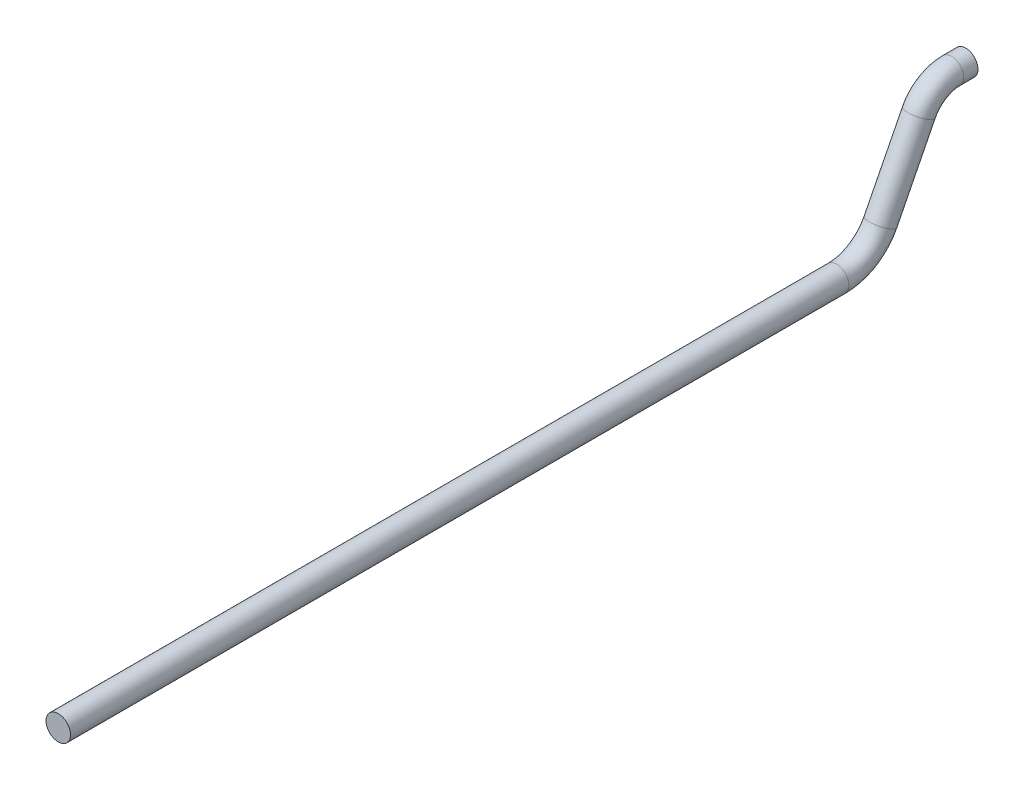
ISO-10303-21;
HEADER;
FILE_DESCRIPTION(('STEP AP214'),'2;1');
FILE_NAME('part.step','',(''),(''),'','','');
FILE_SCHEMA(('AUTOMOTIVE_DESIGN { 1 0 10303 214 1 1 1 1 }'));
ENDSEC;
DATA;
#1=APPLICATION_CONTEXT('core data for automotive mechanical design processes');
#2=APPLICATION_PROTOCOL_DEFINITION('international standard','automotive_design',2000,#1);
#3=PRODUCT_CONTEXT('',#1,'mechanical');
#4=PRODUCT('Part','Part','',(#3));
#5=PRODUCT_RELATED_PRODUCT_CATEGORY('part','',(#4));
#6=PRODUCT_DEFINITION_FORMATION('','',#4);
#7=PRODUCT_DEFINITION_CONTEXT('part definition',#1,'design');
#8=PRODUCT_DEFINITION('design','',#6,#7);
#9=PRODUCT_DEFINITION_SHAPE('','',#8);
#10=(LENGTH_UNIT() NAMED_UNIT(*) SI_UNIT(.MILLI.,.METRE.));
#11=(NAMED_UNIT(*) PLANE_ANGLE_UNIT() SI_UNIT($,.RADIAN.));
#12=(NAMED_UNIT(*) SI_UNIT($,.STERADIAN.) SOLID_ANGLE_UNIT());
#13=UNCERTAINTY_MEASURE_WITH_UNIT(LENGTH_MEASURE(1.E-05),#10,'distance_accuracy_value','');
#14=(GEOMETRIC_REPRESENTATION_CONTEXT(3) GLOBAL_UNCERTAINTY_ASSIGNED_CONTEXT((#13)) GLOBAL_UNIT_ASSIGNED_CONTEXT((#10,
#11,#12)) REPRESENTATION_CONTEXT('',''));
#15=CARTESIAN_POINT('',(0.,0.,0.));
#16=DIRECTION('',(0.,0.,1.));
#17=DIRECTION('',(1.,0.,0.));
#18=AXIS2_PLACEMENT_3D('',#15,#16,#17);
#19=CARTESIAN_POINT('',(0.,-50.,370.));
#20=DIRECTION('',(0.,0.,-1.));
#21=DIRECTION('',(-1.,0.,0.));
#22=AXIS2_PLACEMENT_3D('',#19,#20,#21);
#23=PLANE('',#22);
#24=CARTESIAN_POINT('',(0.,-50.,370.));
#25=DIRECTION('',(0.,0.,-1.));
#26=DIRECTION('',(-1.,0.,0.));
#27=AXIS2_PLACEMENT_3D('',#24,#25,#26);
#28=CIRCLE('',#27,5.);
#29=CARTESIAN_POINT('',(-5.,-50.,370.));
#30=VERTEX_POINT('',#29);
#31=EDGE_CURVE('E82',#30,#30,#28,.T.);
#32=ORIENTED_EDGE('',*,*,#31,.F.);
#33=EDGE_LOOP('',(#32));
#34=FACE_BOUND('',#33,.T.);
#35=ADVANCED_FACE('F55',(#34),#23,.F.);
#36=CARTESIAN_POINT('',(0.,0.,0.));
#37=DIRECTION('',(0.,0.,-1.));
#38=DIRECTION('',(-1.,0.,0.));
#39=AXIS2_PLACEMENT_3D('',#36,#37,#38);
#40=PLANE('',#39);
#41=CARTESIAN_POINT('',(0.,0.,0.));
#42=DIRECTION('',(0.,0.,-1.));
#43=DIRECTION('',(-1.,0.,0.));
#44=AXIS2_PLACEMENT_3D('',#41,#42,#43);
#45=CIRCLE('',#44,5.);
#46=CARTESIAN_POINT('',(-5.,0.,0.));
#47=VERTEX_POINT('',#46);
#48=EDGE_CURVE('E11',#47,#47,#45,.T.);
#49=ORIENTED_EDGE('',*,*,#48,.T.);
#50=EDGE_LOOP('',(#49));
#51=FACE_BOUND('',#50,.T.);
#52=ADVANCED_FACE('F90',(#51),#40,.T.);
#53=CARTESIAN_POINT('',(0.,-50.,370.));
#54=DIRECTION('',(0.,0.,-1.));
#55=DIRECTION('',(-1.,0.,0.));
#56=AXIS2_PLACEMENT_3D('',#53,#54,#55);
#57=CYLINDRICAL_SURFACE('',#56,5.);
#58=CARTESIAN_POINT('',(0.,-50.,52.6209699499409));
#59=DIRECTION('',(0.,0.,-1.));
#60=DIRECTION('',(-1.,0.,0.));
#61=AXIS2_PLACEMENT_3D('',#58,#59,#60);
#62=CIRCLE('',#61,5.);
#63=CARTESIAN_POINT('',(0.,-55.0000000000021,52.6209699499409));
#64=VERTEX_POINT('',#63);
#65=EDGE_CURVE('E78',#64,#64,#62,.T.);
#66=ORIENTED_EDGE('',*,*,#65,.F.);
#67=EDGE_LOOP('',(#66));
#68=FACE_BOUND('',#67,.T.);
#69=ORIENTED_EDGE('',*,*,#31,.T.);
#70=EDGE_LOOP('',(#69));
#71=FACE_BOUND('',#70,.T.);
#72=ADVANCED_FACE('F87',(#68,#71),#57,.T.);
#73=CARTESIAN_POINT('',(0.,-30.,52.6209699499408));
#74=DIRECTION('',(1.,0.,0.));
#75=DIRECTION('',(0.,0.,-1.));
#76=AXIS2_PLACEMENT_3D('',#73,#74,#75);
#77=TOROIDAL_SURFACE('',#76,20.0000000000021,5.);
#78=CARTESIAN_POINT('',(0.,-39.039421146903,34.7803179066739));
#79=DIRECTION('',(0.,0.892032602163345,-0.451971057345149));
#80=DIRECTION('',(-1.,0.,0.));
#81=AXIS2_PLACEMENT_3D('',#78,#79,#80);
#82=CIRCLE('',#81,5.);
#83=CARTESIAN_POINT('',(0.,-41.2992764336297,30.3201548958554));
#84=VERTEX_POINT('',#83);
#85=EDGE_CURVE('E72',#84,#84,#82,.T.);
#86=CARTESIAN_POINT('',(0.,-30.,52.6209699499408));
#87=DIRECTION('',(1.,0.,0.));
#88=DIRECTION('',(0.,0.,-1.));
#89=AXIS2_PLACEMENT_3D('',#86,#87,#88);
#90=CIRCLE('',#89,25.0000000000021);
#91=EDGE_CURVE('',#64,#84,#90,.T.);
#92=ORIENTED_EDGE('',*,*,#65,.T.);
#93=ORIENTED_EDGE('',*,*,#85,.F.);
#94=ORIENTED_EDGE('',*,*,#91,.T.);
#95=ORIENTED_EDGE('',*,*,#91,.F.);
#96=EDGE_LOOP('',(#92,#94,#93,#95));
#97=FACE_BOUND('',#96,.T.);
#98=ADVANCED_FACE('F108',(#97),#77,.T.);
#99=CARTESIAN_POINT('',(0.,-39.039421146903,34.7803179066739));
#100=DIRECTION('',(0.,0.892032602163342,-0.451971057345154));
#101=DIRECTION('',(0.,0.451971057345154,0.892032602163342));
#102=AXIS2_PLACEMENT_3D('',#99,#100,#101);
#103=CYLINDRICAL_SURFACE('',#102,5.);
#104=CARTESIAN_POINT('',(0.,-8.22043413982276,19.1650925100735));
#105=DIRECTION('',(0.,0.892032602163342,-0.451971057345154));
#106=DIRECTION('',(-1.,0.,0.));
#107=AXIS2_PLACEMENT_3D('',#104,#105,#106);
#108=CIRCLE('',#107,5.);
#109=CARTESIAN_POINT('',(0.,-5.96057885309702,23.6252555208902));
#110=VERTEX_POINT('',#109);
#111=EDGE_CURVE('E67',#110,#110,#108,.T.);
#112=ORIENTED_EDGE('',*,*,#111,.F.);
#113=EDGE_LOOP('',(#112));
#114=FACE_BOUND('',#113,.T.);
#115=ORIENTED_EDGE('',*,*,#85,.T.);
#116=EDGE_LOOP('',(#115));
#117=FACE_BOUND('',#116,.T.);
#118=ADVANCED_FACE('F102',(#114,#117),#103,.T.);
#119=CARTESIAN_POINT('',(0.,-15.,5.78460347762331));
#120=DIRECTION('',(-1.,0.,0.));
#121=DIRECTION('',(0.,0.,1.));
#122=AXIS2_PLACEMENT_3D('',#119,#120,#121);
#123=TOROIDAL_SURFACE('',#122,15.,5.);
#124=CARTESIAN_POINT('',(0.,-1.90125692967058E-12,5.784603477623));
#125=DIRECTION('',(0.,0.,-1.));
#126=DIRECTION('',(-1.,0.,0.));
#127=AXIS2_PLACEMENT_3D('',#124,#125,#126);
#128=CIRCLE('',#127,5.);
#129=CARTESIAN_POINT('',(0.,4.99999999999999,5.78460347762289));
#130=VERTEX_POINT('',#129);
#131=EDGE_CURVE('E62',#130,#130,#128,.T.);
#132=CARTESIAN_POINT('',(0.,-15.,5.78460347762331));
#133=DIRECTION('',(-1.,0.,0.));
#134=DIRECTION('',(0.,0.,1.));
#135=AXIS2_PLACEMENT_3D('',#132,#133,#134);
#136=CIRCLE('',#135,20.);
#137=EDGE_CURVE('',#110,#130,#136,.T.);
#138=ORIENTED_EDGE('',*,*,#111,.T.);
#139=ORIENTED_EDGE('',*,*,#131,.F.);
#140=ORIENTED_EDGE('',*,*,#137,.T.);
#141=ORIENTED_EDGE('',*,*,#137,.F.);
#142=EDGE_LOOP('',(#138,#140,#139,#141));
#143=FACE_BOUND('',#142,.T.);
#144=ADVANCED_FACE('F96',(#143),#123,.T.);
#145=CARTESIAN_POINT('',(0.,0.,5.78460347762322));
#146=DIRECTION('',(0.,0.,-1.));
#147=DIRECTION('',(0.,1.,0.));
#148=AXIS2_PLACEMENT_3D('',#145,#146,#147);
#149=CYLINDRICAL_SURFACE('',#148,5.);
#150=ORIENTED_EDGE('',*,*,#48,.F.);
#151=EDGE_LOOP('',(#150));
#152=FACE_BOUND('',#151,.T.);
#153=ORIENTED_EDGE('',*,*,#131,.T.);
#154=EDGE_LOOP('',(#153));
#155=FACE_BOUND('',#154,.T.);
#156=ADVANCED_FACE('F94',(#152,#155),#149,.T.);
#157=CLOSED_SHELL('',(#35,#52,#72,#98,#118,#144,#156));
#158=MANIFOLD_SOLID_BREP('B2',#157);
#159=ADVANCED_BREP_SHAPE_REPRESENTATION('',(#18,#158),#14);
#160=SHAPE_DEFINITION_REPRESENTATION(#9,#159);
ENDSEC;
END-ISO-10303-21;
